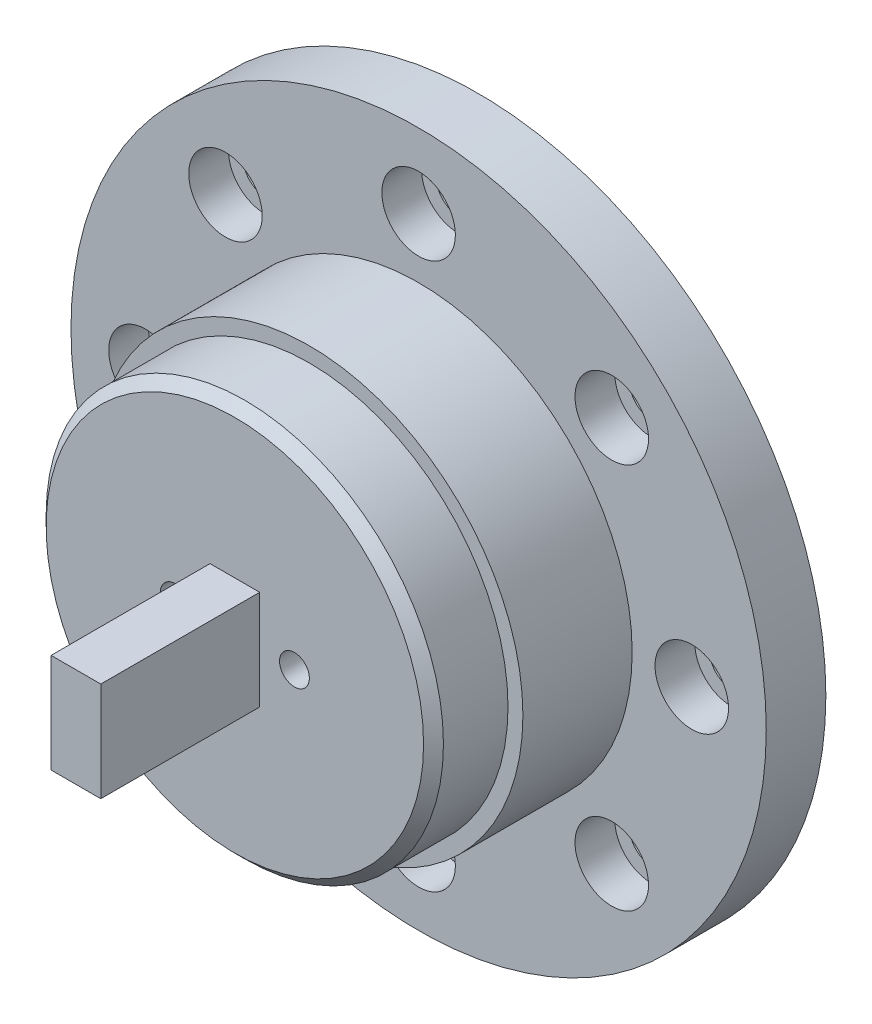
ISO-10303-21;
HEADER;
FILE_DESCRIPTION(('STEP AP214'),'2;1');
FILE_NAME('part.step','',(''),(''),'','','');
FILE_SCHEMA(('AUTOMOTIVE_DESIGN { 1 0 10303 214 1 1 1 1 }'));
ENDSEC;
DATA;
#1=APPLICATION_CONTEXT('core data for automotive mechanical design processes');
#2=APPLICATION_PROTOCOL_DEFINITION('international standard','automotive_design',2000,#1);
#3=PRODUCT_CONTEXT('',#1,'mechanical');
#4=PRODUCT('Part','Part','',(#3));
#5=PRODUCT_RELATED_PRODUCT_CATEGORY('part','',(#4));
#6=PRODUCT_DEFINITION_FORMATION('','',#4);
#7=PRODUCT_DEFINITION_CONTEXT('part definition',#1,'design');
#8=PRODUCT_DEFINITION('design','',#6,#7);
#9=PRODUCT_DEFINITION_SHAPE('','',#8);
#10=(LENGTH_UNIT() NAMED_UNIT(*) SI_UNIT(.MILLI.,.METRE.));
#11=(NAMED_UNIT(*) PLANE_ANGLE_UNIT() SI_UNIT($,.RADIAN.));
#12=(NAMED_UNIT(*) SI_UNIT($,.STERADIAN.) SOLID_ANGLE_UNIT());
#13=UNCERTAINTY_MEASURE_WITH_UNIT(LENGTH_MEASURE(1.E-05),#10,'distance_accuracy_value','');
#14=(GEOMETRIC_REPRESENTATION_CONTEXT(3) GLOBAL_UNCERTAINTY_ASSIGNED_CONTEXT((#13)) GLOBAL_UNIT_ASSIGNED_CONTEXT((#10,
#11,#12)) REPRESENTATION_CONTEXT('',''));
#15=CARTESIAN_POINT('',(0.,0.,0.));
#16=DIRECTION('',(0.,0.,1.));
#17=DIRECTION('',(1.,0.,0.));
#18=AXIS2_PLACEMENT_3D('',#15,#16,#17);
#19=CARTESIAN_POINT('',(0.,0.,2.));
#20=DIRECTION('',(0.,0.,1.));
#21=DIRECTION('',(1.,0.,0.));
#22=AXIS2_PLACEMENT_3D('',#19,#20,#21);
#23=PLANE('',#22);
#24=CARTESIAN_POINT('',(-27.5,0.,2.));
#25=DIRECTION('',(0.,0.,1.));
#26=DIRECTION('',(1.,0.,0.));
#27=AXIS2_PLACEMENT_3D('',#24,#25,#26);
#28=CIRCLE('',#27,2.2);
#29=CARTESIAN_POINT('',(-25.3,0.,2.));
#30=VERTEX_POINT('',#29);
#31=EDGE_CURVE('E192',#30,#30,#28,.T.);
#32=ORIENTED_EDGE('',*,*,#31,.F.);
#33=EDGE_LOOP('',(#32));
#34=FACE_BOUND('',#33,.T.);
#35=CARTESIAN_POINT('',(-27.5,0.,2.));
#36=DIRECTION('',(0.,0.,1.));
#37=DIRECTION('',(1.,0.,0.));
#38=AXIS2_PLACEMENT_3D('',#35,#36,#37);
#39=CIRCLE('',#38,3.7);
#40=CARTESIAN_POINT('',(-23.8,0.,2.));
#41=VERTEX_POINT('',#40);
#42=EDGE_CURVE('E134',#41,#41,#39,.T.);
#43=ORIENTED_EDGE('',*,*,#42,.T.);
#44=EDGE_LOOP('',(#43));
#45=FACE_BOUND('',#44,.T.);
#46=ADVANCED_FACE('F55',(#34,#45),#23,.T.);
#47=CARTESIAN_POINT('',(0.,-27.5,2.));
#48=DIRECTION('',(0.,0.,1.));
#49=DIRECTION('',(1.,0.,0.));
#50=AXIS2_PLACEMENT_3D('',#47,#48,#49);
#51=CIRCLE('',#50,2.2);
#52=CARTESIAN_POINT('',(2.2,-27.5,2.));
#53=VERTEX_POINT('',#52);
#54=EDGE_CURVE('E204',#53,#53,#51,.T.);
#55=ORIENTED_EDGE('',*,*,#54,.F.);
#56=EDGE_LOOP('',(#55));
#57=FACE_BOUND('',#56,.T.);
#58=CARTESIAN_POINT('',(0.,-27.5,2.));
#59=DIRECTION('',(0.,0.,1.));
#60=DIRECTION('',(1.,0.,0.));
#61=AXIS2_PLACEMENT_3D('',#58,#59,#60);
#62=CIRCLE('',#61,3.7);
#63=CARTESIAN_POINT('',(3.7,-27.5,2.));
#64=VERTEX_POINT('',#63);
#65=EDGE_CURVE('E166',#64,#64,#62,.T.);
#66=ORIENTED_EDGE('',*,*,#65,.T.);
#67=EDGE_LOOP('',(#66));
#68=FACE_BOUND('',#67,.T.);
#69=ADVANCED_FACE('F256',(#57,#68),#23,.T.);
#70=CARTESIAN_POINT('',(27.5,0.,2.));
#71=DIRECTION('',(0.,0.,1.));
#72=DIRECTION('',(1.,0.,0.));
#73=AXIS2_PLACEMENT_3D('',#70,#71,#72);
#74=CIRCLE('',#73,2.2);
#75=CARTESIAN_POINT('',(29.7,0.,2.));
#76=VERTEX_POINT('',#75);
#77=EDGE_CURVE('E216',#76,#76,#74,.T.);
#78=ORIENTED_EDGE('',*,*,#77,.F.);
#79=EDGE_LOOP('',(#78));
#80=FACE_BOUND('',#79,.T.);
#81=CARTESIAN_POINT('',(27.5,0.,2.));
#82=DIRECTION('',(0.,0.,1.));
#83=DIRECTION('',(1.,0.,0.));
#84=AXIS2_PLACEMENT_3D('',#81,#82,#83);
#85=CIRCLE('',#84,3.7);
#86=CARTESIAN_POINT('',(31.2,0.,2.));
#87=VERTEX_POINT('',#86);
#88=EDGE_CURVE('E169',#87,#87,#85,.T.);
#89=ORIENTED_EDGE('',*,*,#88,.T.);
#90=EDGE_LOOP('',(#89));
#91=FACE_BOUND('',#90,.T.);
#92=ADVANCED_FACE('F264',(#80,#91),#23,.T.);
#93=CARTESIAN_POINT('',(0.,27.5,2.));
#94=DIRECTION('',(0.,0.,1.));
#95=DIRECTION('',(1.,0.,0.));
#96=AXIS2_PLACEMENT_3D('',#93,#94,#95);
#97=CIRCLE('',#96,2.2);
#98=CARTESIAN_POINT('',(2.2,27.5,2.));
#99=VERTEX_POINT('',#98);
#100=EDGE_CURVE('E228',#99,#99,#97,.T.);
#101=ORIENTED_EDGE('',*,*,#100,.F.);
#102=EDGE_LOOP('',(#101));
#103=FACE_BOUND('',#102,.T.);
#104=CARTESIAN_POINT('',(0.,27.5,2.));
#105=DIRECTION('',(0.,0.,1.));
#106=DIRECTION('',(1.,0.,0.));
#107=AXIS2_PLACEMENT_3D('',#104,#105,#106);
#108=CIRCLE('',#107,3.7);
#109=CARTESIAN_POINT('',(3.7,27.5,2.));
#110=VERTEX_POINT('',#109);
#111=EDGE_CURVE('E172',#110,#110,#108,.T.);
#112=ORIENTED_EDGE('',*,*,#111,.T.);
#113=EDGE_LOOP('',(#112));
#114=FACE_BOUND('',#113,.T.);
#115=ADVANCED_FACE('F383',(#103,#114),#23,.T.);
#116=CARTESIAN_POINT('',(19.4454364826301,19.4454364826301,2.));
#117=DIRECTION('',(0.,0.,1.));
#118=DIRECTION('',(1.,0.,0.));
#119=AXIS2_PLACEMENT_3D('',#116,#117,#118);
#120=CIRCLE('',#119,2.20000000000001);
#121=CARTESIAN_POINT('',(21.6454364826301,19.4454364826301,2.));
#122=VERTEX_POINT('',#121);
#123=EDGE_CURVE('E222',#122,#122,#120,.T.);
#124=ORIENTED_EDGE('',*,*,#123,.F.);
#125=EDGE_LOOP('',(#124));
#126=FACE_BOUND('',#125,.T.);
#127=CARTESIAN_POINT('',(19.4454364826301,19.4454364826301,2.));
#128=DIRECTION('',(0.,0.,1.));
#129=DIRECTION('',(1.,0.,0.));
#130=AXIS2_PLACEMENT_3D('',#127,#128,#129);
#131=CIRCLE('',#130,3.70000000000001);
#132=CARTESIAN_POINT('',(23.1454364826301,19.4454364826301,2.));
#133=VERTEX_POINT('',#132);
#134=EDGE_CURVE('E175',#133,#133,#131,.T.);
#135=ORIENTED_EDGE('',*,*,#134,.T.);
#136=EDGE_LOOP('',(#135));
#137=FACE_BOUND('',#136,.T.);
#138=ADVANCED_FACE('F386',(#126,#137),#23,.T.);
#139=CARTESIAN_POINT('',(19.4454364826301,-19.4454364826301,2.));
#140=DIRECTION('',(0.,0.,1.));
#141=DIRECTION('',(1.,0.,0.));
#142=AXIS2_PLACEMENT_3D('',#139,#140,#141);
#143=CIRCLE('',#142,2.20000000000001);
#144=CARTESIAN_POINT('',(21.6454364826301,-19.4454364826301,2.));
#145=VERTEX_POINT('',#144);
#146=EDGE_CURVE('E210',#145,#145,#143,.T.);
#147=ORIENTED_EDGE('',*,*,#146,.F.);
#148=EDGE_LOOP('',(#147));
#149=FACE_BOUND('',#148,.T.);
#150=CARTESIAN_POINT('',(19.4454364826301,-19.4454364826301,2.));
#151=DIRECTION('',(0.,0.,1.));
#152=DIRECTION('',(1.,0.,0.));
#153=AXIS2_PLACEMENT_3D('',#150,#151,#152);
#154=CIRCLE('',#153,3.70000000000001);
#155=CARTESIAN_POINT('',(23.1454364826301,-19.4454364826301,2.));
#156=VERTEX_POINT('',#155);
#157=EDGE_CURVE('E178',#156,#156,#154,.T.);
#158=ORIENTED_EDGE('',*,*,#157,.T.);
#159=EDGE_LOOP('',(#158));
#160=FACE_BOUND('',#159,.T.);
#161=ADVANCED_FACE('F281',(#149,#160),#23,.T.);
#162=CARTESIAN_POINT('',(-19.4454364826301,-19.4454364826301,2.));
#163=DIRECTION('',(0.,0.,1.));
#164=DIRECTION('',(1.,0.,0.));
#165=AXIS2_PLACEMENT_3D('',#162,#163,#164);
#166=CIRCLE('',#165,2.2);
#167=CARTESIAN_POINT('',(-17.2454364826301,-19.4454364826301,2.));
#168=VERTEX_POINT('',#167);
#169=EDGE_CURVE('E198',#168,#168,#166,.T.);
#170=ORIENTED_EDGE('',*,*,#169,.F.);
#171=EDGE_LOOP('',(#170));
#172=FACE_BOUND('',#171,.T.);
#173=CARTESIAN_POINT('',(-19.4454364826301,-19.4454364826301,2.));
#174=DIRECTION('',(0.,0.,1.));
#175=DIRECTION('',(1.,0.,0.));
#176=AXIS2_PLACEMENT_3D('',#173,#174,#175);
#177=CIRCLE('',#176,3.7);
#178=CARTESIAN_POINT('',(-15.7454364826301,-19.4454364826301,2.));
#179=VERTEX_POINT('',#178);
#180=EDGE_CURVE('E181',#179,#179,#177,.T.);
#181=ORIENTED_EDGE('',*,*,#180,.T.);
#182=EDGE_LOOP('',(#181));
#183=FACE_BOUND('',#182,.T.);
#184=ADVANCED_FACE('F272',(#172,#183),#23,.T.);
#185=CARTESIAN_POINT('',(-19.4454364826301,19.4454364826301,2.));
#186=DIRECTION('',(0.,0.,1.));
#187=DIRECTION('',(1.,0.,0.));
#188=AXIS2_PLACEMENT_3D('',#185,#186,#187);
#189=CIRCLE('',#188,2.2);
#190=CARTESIAN_POINT('',(-17.2454364826301,19.4454364826301,2.));
#191=VERTEX_POINT('',#190);
#192=EDGE_CURVE('E186',#191,#191,#189,.T.);
#193=ORIENTED_EDGE('',*,*,#192,.F.);
#194=EDGE_LOOP('',(#193));
#195=FACE_BOUND('',#194,.T.);
#196=CARTESIAN_POINT('',(-19.4454364826301,19.4454364826301,2.));
#197=DIRECTION('',(0.,0.,1.));
#198=DIRECTION('',(1.,0.,0.));
#199=AXIS2_PLACEMENT_3D('',#196,#197,#198);
#200=CIRCLE('',#199,3.7);
#201=CARTESIAN_POINT('',(-15.7454364826301,19.4454364826301,2.));
#202=VERTEX_POINT('',#201);
#203=EDGE_CURVE('E139',#202,#202,#200,.T.);
#204=ORIENTED_EDGE('',*,*,#203,.T.);
#205=EDGE_LOOP('',(#204));
#206=FACE_BOUND('',#205,.T.);
#207=ADVANCED_FACE('F259',(#195,#206),#23,.T.);
#208=CARTESIAN_POINT('',(0.,0.,0.));
#209=DIRECTION('',(0.,0.,1.));
#210=DIRECTION('',(1.,0.,0.));
#211=AXIS2_PLACEMENT_3D('',#208,#209,#210);
#212=PLANE('',#211);
#213=CARTESIAN_POINT('',(-6.,0.,0.));
#214=DIRECTION('',(0.,0.,1.));
#215=DIRECTION('',(1.,0.,0.));
#216=AXIS2_PLACEMENT_3D('',#213,#214,#215);
#217=CIRCLE('',#216,1.5);
#218=CARTESIAN_POINT('',(-4.5,0.,0.));
#219=VERTEX_POINT('',#218);
#220=EDGE_CURVE('E673',#219,#219,#217,.T.);
#221=ORIENTED_EDGE('',*,*,#220,.T.);
#222=EDGE_LOOP('',(#221));
#223=FACE_BOUND('',#222,.T.);
#224=CARTESIAN_POINT('',(6.,0.,0.));
#225=DIRECTION('',(0.,0.,1.));
#226=DIRECTION('',(1.,0.,0.));
#227=AXIS2_PLACEMENT_3D('',#224,#225,#226);
#228=CIRCLE('',#227,1.5);
#229=CARTESIAN_POINT('',(7.5,0.,0.));
#230=VERTEX_POINT('',#229);
#231=EDGE_CURVE('E665',#230,#230,#228,.T.);
#232=ORIENTED_EDGE('',*,*,#231,.T.);
#233=EDGE_LOOP('',(#232));
#234=FACE_BOUND('',#233,.T.);
#235=CARTESIAN_POINT('',(0.,0.,0.));
#236=DIRECTION('',(0.,0.,1.));
#237=DIRECTION('',(1.,0.,0.));
#238=AXIS2_PLACEMENT_3D('',#235,#236,#237);
#239=CIRCLE('',#238,35.);
#240=CARTESIAN_POINT('',(35.,0.,0.));
#241=VERTEX_POINT('',#240);
#242=EDGE_CURVE('E231',#241,#241,#239,.T.);
#243=ORIENTED_EDGE('',*,*,#242,.F.);
#244=EDGE_LOOP('',(#243));
#245=FACE_BOUND('',#244,.T.);
#246=CARTESIAN_POINT('',(0.,27.5,0.));
#247=DIRECTION('',(0.,0.,1.));
#248=DIRECTION('',(1.,0.,0.));
#249=AXIS2_PLACEMENT_3D('',#246,#247,#248);
#250=CIRCLE('',#249,2.2);
#251=CARTESIAN_POINT('',(2.2,27.5,0.));
#252=VERTEX_POINT('',#251);
#253=EDGE_CURVE('E225',#252,#252,#250,.T.);
#254=ORIENTED_EDGE('',*,*,#253,.T.);
#255=EDGE_LOOP('',(#254));
#256=FACE_BOUND('',#255,.T.);
#257=CARTESIAN_POINT('',(19.4454364826301,19.4454364826301,0.));
#258=DIRECTION('',(0.,0.,1.));
#259=DIRECTION('',(1.,0.,0.));
#260=AXIS2_PLACEMENT_3D('',#257,#258,#259);
#261=CIRCLE('',#260,2.20000000000001);
#262=CARTESIAN_POINT('',(21.6454364826301,19.4454364826301,0.));
#263=VERTEX_POINT('',#262);
#264=EDGE_CURVE('E219',#263,#263,#261,.T.);
#265=ORIENTED_EDGE('',*,*,#264,.T.);
#266=EDGE_LOOP('',(#265));
#267=FACE_BOUND('',#266,.T.);
#268=CARTESIAN_POINT('',(27.5,0.,0.));
#269=DIRECTION('',(0.,0.,1.));
#270=DIRECTION('',(1.,0.,0.));
#271=AXIS2_PLACEMENT_3D('',#268,#269,#270);
#272=CIRCLE('',#271,2.2);
#273=CARTESIAN_POINT('',(29.7,0.,0.));
#274=VERTEX_POINT('',#273);
#275=EDGE_CURVE('E213',#274,#274,#272,.T.);
#276=ORIENTED_EDGE('',*,*,#275,.T.);
#277=EDGE_LOOP('',(#276));
#278=FACE_BOUND('',#277,.T.);
#279=CARTESIAN_POINT('',(19.4454364826301,-19.4454364826301,0.));
#280=DIRECTION('',(0.,0.,1.));
#281=DIRECTION('',(1.,0.,0.));
#282=AXIS2_PLACEMENT_3D('',#279,#280,#281);
#283=CIRCLE('',#282,2.20000000000001);
#284=CARTESIAN_POINT('',(21.6454364826301,-19.4454364826301,0.));
#285=VERTEX_POINT('',#284);
#286=EDGE_CURVE('E207',#285,#285,#283,.T.);
#287=ORIENTED_EDGE('',*,*,#286,.T.);
#288=EDGE_LOOP('',(#287));
#289=FACE_BOUND('',#288,.T.);
#290=CARTESIAN_POINT('',(0.,-27.5,0.));
#291=DIRECTION('',(0.,0.,1.));
#292=DIRECTION('',(1.,0.,0.));
#293=AXIS2_PLACEMENT_3D('',#290,#291,#292);
#294=CIRCLE('',#293,2.2);
#295=CARTESIAN_POINT('',(2.2,-27.5,0.));
#296=VERTEX_POINT('',#295);
#297=EDGE_CURVE('E201',#296,#296,#294,.T.);
#298=ORIENTED_EDGE('',*,*,#297,.T.);
#299=EDGE_LOOP('',(#298));
#300=FACE_BOUND('',#299,.T.);
#301=CARTESIAN_POINT('',(-19.4454364826301,-19.4454364826301,0.));
#302=DIRECTION('',(0.,0.,1.));
#303=DIRECTION('',(1.,0.,0.));
#304=AXIS2_PLACEMENT_3D('',#301,#302,#303);
#305=CIRCLE('',#304,2.2);
#306=CARTESIAN_POINT('',(-17.2454364826301,-19.4454364826301,0.));
#307=VERTEX_POINT('',#306);
#308=EDGE_CURVE('E195',#307,#307,#305,.T.);
#309=ORIENTED_EDGE('',*,*,#308,.T.);
#310=EDGE_LOOP('',(#309));
#311=FACE_BOUND('',#310,.T.);
#312=CARTESIAN_POINT('',(-27.5,0.,0.));
#313=DIRECTION('',(0.,0.,1.));
#314=DIRECTION('',(1.,0.,0.));
#315=AXIS2_PLACEMENT_3D('',#312,#313,#314);
#316=CIRCLE('',#315,2.2);
#317=CARTESIAN_POINT('',(-25.3,0.,0.));
#318=VERTEX_POINT('',#317);
#319=EDGE_CURVE('E189',#318,#318,#316,.T.);
#320=ORIENTED_EDGE('',*,*,#319,.T.);
#321=EDGE_LOOP('',(#320));
#322=FACE_BOUND('',#321,.T.);
#323=CARTESIAN_POINT('',(-19.4454364826301,19.4454364826301,0.));
#324=DIRECTION('',(0.,0.,1.));
#325=DIRECTION('',(1.,0.,0.));
#326=AXIS2_PLACEMENT_3D('',#323,#324,#325);
#327=CIRCLE('',#326,2.2);
#328=CARTESIAN_POINT('',(-17.2454364826301,19.4454364826301,0.));
#329=VERTEX_POINT('',#328);
#330=EDGE_CURVE('E163',#329,#329,#327,.T.);
#331=ORIENTED_EDGE('',*,*,#330,.T.);
#332=EDGE_LOOP('',(#331));
#333=FACE_BOUND('',#332,.T.);
#334=ADVANCED_FACE('F271',(#223,#234,#245,#256,#267,#278,#289,#300,#311,#322,#333),#212,.F.);
#335=CARTESIAN_POINT('',(0.,0.,2.));
#336=DIRECTION('',(0.,0.,-1.));
#337=DIRECTION('',(-1.,0.,0.));
#338=AXIS2_PLACEMENT_3D('',#335,#336,#337);
#339=CYLINDRICAL_SURFACE('',#338,35.);
#340=ORIENTED_EDGE('',*,*,#242,.T.);
#341=EDGE_LOOP('',(#340));
#342=FACE_BOUND('',#341,.T.);
#343=CARTESIAN_POINT('',(0.,0.,6.));
#344=DIRECTION('',(0.,0.,1.));
#345=DIRECTION('',(1.,0.,0.));
#346=AXIS2_PLACEMENT_3D('',#343,#344,#345);
#347=CIRCLE('',#346,35.);
#348=CARTESIAN_POINT('',(35.,0.,6.));
#349=VERTEX_POINT('',#348);
#350=EDGE_CURVE('E160',#349,#349,#347,.T.);
#351=ORIENTED_EDGE('',*,*,#350,.F.);
#352=EDGE_LOOP('',(#351));
#353=FACE_BOUND('',#352,.T.);
#354=ADVANCED_FACE('F279',(#342,#353),#339,.T.);
#355=CARTESIAN_POINT('',(0.,27.5,2.));
#356=DIRECTION('',(0.,0.,-1.));
#357=DIRECTION('',(-1.,0.,0.));
#358=AXIS2_PLACEMENT_3D('',#355,#356,#357);
#359=CYLINDRICAL_SURFACE('',#358,2.2);
#360=ORIENTED_EDGE('',*,*,#100,.T.);
#361=EDGE_LOOP('',(#360));
#362=FACE_BOUND('',#361,.T.);
#363=ORIENTED_EDGE('',*,*,#253,.F.);
#364=EDGE_LOOP('',(#363));
#365=FACE_BOUND('',#364,.T.);
#366=ADVANCED_FACE('F350',(#362,#365),#359,.F.);
#367=CARTESIAN_POINT('',(19.4454364826301,19.4454364826301,2.));
#368=DIRECTION('',(0.,0.,-1.));
#369=DIRECTION('',(-1.,0.,0.));
#370=AXIS2_PLACEMENT_3D('',#367,#368,#369);
#371=CYLINDRICAL_SURFACE('',#370,2.20000000000001);
#372=ORIENTED_EDGE('',*,*,#123,.T.);
#373=EDGE_LOOP('',(#372));
#374=FACE_BOUND('',#373,.T.);
#375=ORIENTED_EDGE('',*,*,#264,.F.);
#376=EDGE_LOOP('',(#375));
#377=FACE_BOUND('',#376,.T.);
#378=ADVANCED_FACE('F347',(#374,#377),#371,.F.);
#379=CARTESIAN_POINT('',(27.5,0.,2.));
#380=DIRECTION('',(0.,0.,-1.));
#381=DIRECTION('',(-1.,0.,0.));
#382=AXIS2_PLACEMENT_3D('',#379,#380,#381);
#383=CYLINDRICAL_SURFACE('',#382,2.2);
#384=ORIENTED_EDGE('',*,*,#77,.T.);
#385=EDGE_LOOP('',(#384));
#386=FACE_BOUND('',#385,.T.);
#387=ORIENTED_EDGE('',*,*,#275,.F.);
#388=EDGE_LOOP('',(#387));
#389=FACE_BOUND('',#388,.T.);
#390=ADVANCED_FACE('F343',(#386,#389),#383,.F.);
#391=CARTESIAN_POINT('',(19.4454364826301,-19.4454364826301,2.));
#392=DIRECTION('',(0.,0.,-1.));
#393=DIRECTION('',(-1.,0.,0.));
#394=AXIS2_PLACEMENT_3D('',#391,#392,#393);
#395=CYLINDRICAL_SURFACE('',#394,2.20000000000001);
#396=ORIENTED_EDGE('',*,*,#146,.T.);
#397=EDGE_LOOP('',(#396));
#398=FACE_BOUND('',#397,.T.);
#399=ORIENTED_EDGE('',*,*,#286,.F.);
#400=EDGE_LOOP('',(#399));
#401=FACE_BOUND('',#400,.T.);
#402=ADVANCED_FACE('F339',(#398,#401),#395,.F.);
#403=CARTESIAN_POINT('',(0.,-27.5,2.));
#404=DIRECTION('',(0.,0.,-1.));
#405=DIRECTION('',(-1.,0.,0.));
#406=AXIS2_PLACEMENT_3D('',#403,#404,#405);
#407=CYLINDRICAL_SURFACE('',#406,2.2);
#408=ORIENTED_EDGE('',*,*,#54,.T.);
#409=EDGE_LOOP('',(#408));
#410=FACE_BOUND('',#409,.T.);
#411=ORIENTED_EDGE('',*,*,#297,.F.);
#412=EDGE_LOOP('',(#411));
#413=FACE_BOUND('',#412,.T.);
#414=ADVANCED_FACE('F335',(#410,#413),#407,.F.);
#415=CARTESIAN_POINT('',(-19.4454364826301,-19.4454364826301,2.));
#416=DIRECTION('',(0.,0.,-1.));
#417=DIRECTION('',(-1.,0.,0.));
#418=AXIS2_PLACEMENT_3D('',#415,#416,#417);
#419=CYLINDRICAL_SURFACE('',#418,2.2);
#420=ORIENTED_EDGE('',*,*,#169,.T.);
#421=EDGE_LOOP('',(#420));
#422=FACE_BOUND('',#421,.T.);
#423=ORIENTED_EDGE('',*,*,#308,.F.);
#424=EDGE_LOOP('',(#423));
#425=FACE_BOUND('',#424,.T.);
#426=ADVANCED_FACE('F331',(#422,#425),#419,.F.);
#427=CARTESIAN_POINT('',(-27.5,0.,2.));
#428=DIRECTION('',(0.,0.,-1.));
#429=DIRECTION('',(-1.,0.,0.));
#430=AXIS2_PLACEMENT_3D('',#427,#428,#429);
#431=CYLINDRICAL_SURFACE('',#430,2.2);
#432=ORIENTED_EDGE('',*,*,#31,.T.);
#433=EDGE_LOOP('',(#432));
#434=FACE_BOUND('',#433,.T.);
#435=ORIENTED_EDGE('',*,*,#319,.F.);
#436=EDGE_LOOP('',(#435));
#437=FACE_BOUND('',#436,.T.);
#438=ADVANCED_FACE('F299',(#434,#437),#431,.F.);
#439=CARTESIAN_POINT('',(-19.4454364826301,19.4454364826301,2.));
#440=DIRECTION('',(0.,0.,-1.));
#441=DIRECTION('',(-1.,0.,0.));
#442=AXIS2_PLACEMENT_3D('',#439,#440,#441);
#443=CYLINDRICAL_SURFACE('',#442,2.2);
#444=ORIENTED_EDGE('',*,*,#192,.T.);
#445=EDGE_LOOP('',(#444));
#446=FACE_BOUND('',#445,.T.);
#447=ORIENTED_EDGE('',*,*,#330,.F.);
#448=EDGE_LOOP('',(#447));
#449=FACE_BOUND('',#448,.T.);
#450=ADVANCED_FACE('F290',(#446,#449),#443,.F.);
#451=CARTESIAN_POINT('',(-19.4454364826301,19.4454364826301,6.));
#452=DIRECTION('',(0.,0.,-1.));
#453=DIRECTION('',(-1.,0.,0.));
#454=AXIS2_PLACEMENT_3D('',#451,#452,#453);
#455=CYLINDRICAL_SURFACE('',#454,3.7);
#456=CARTESIAN_POINT('',(-19.4454364826301,19.4454364826301,6.));
#457=DIRECTION('',(0.,0.,1.));
#458=DIRECTION('',(1.,0.,0.));
#459=AXIS2_PLACEMENT_3D('',#456,#457,#458);
#460=CIRCLE('',#459,3.7);
#461=CARTESIAN_POINT('',(-15.7454364826301,19.4454364826301,6.));
#462=VERTEX_POINT('',#461);
#463=EDGE_CURVE('E157',#462,#462,#460,.T.);
#464=ORIENTED_EDGE('',*,*,#463,.T.);
#465=EDGE_LOOP('',(#464));
#466=FACE_BOUND('',#465,.T.);
#467=ORIENTED_EDGE('',*,*,#203,.F.);
#468=EDGE_LOOP('',(#467));
#469=FACE_BOUND('',#468,.T.);
#470=ADVANCED_FACE('F287',(#466,#469),#455,.F.);
#471=CARTESIAN_POINT('',(-19.4454364826301,-19.4454364826301,6.));
#472=DIRECTION('',(0.,0.,-1.));
#473=DIRECTION('',(-1.,0.,0.));
#474=AXIS2_PLACEMENT_3D('',#471,#472,#473);
#475=CYLINDRICAL_SURFACE('',#474,3.7);
#476=CARTESIAN_POINT('',(-19.4454364826301,-19.4454364826301,6.));
#477=DIRECTION('',(0.,0.,1.));
#478=DIRECTION('',(1.,0.,0.));
#479=AXIS2_PLACEMENT_3D('',#476,#477,#478);
#480=CIRCLE('',#479,3.7);
#481=CARTESIAN_POINT('',(-15.7454364826301,-19.4454364826301,6.));
#482=VERTEX_POINT('',#481);
#483=EDGE_CURVE('E154',#482,#482,#480,.T.);
#484=ORIENTED_EDGE('',*,*,#483,.T.);
#485=EDGE_LOOP('',(#484));
#486=FACE_BOUND('',#485,.T.);
#487=ORIENTED_EDGE('',*,*,#180,.F.);
#488=EDGE_LOOP('',(#487));
#489=FACE_BOUND('',#488,.T.);
#490=ADVANCED_FACE('F289',(#486,#489),#475,.F.);
#491=CARTESIAN_POINT('',(19.4454364826301,-19.4454364826301,6.));
#492=DIRECTION('',(0.,0.,-1.));
#493=DIRECTION('',(-1.,0.,0.));
#494=AXIS2_PLACEMENT_3D('',#491,#492,#493);
#495=CYLINDRICAL_SURFACE('',#494,3.70000000000001);
#496=CARTESIAN_POINT('',(19.4454364826301,-19.4454364826301,6.));
#497=DIRECTION('',(0.,0.,1.));
#498=DIRECTION('',(1.,0.,0.));
#499=AXIS2_PLACEMENT_3D('',#496,#497,#498);
#500=CIRCLE('',#499,3.70000000000001);
#501=CARTESIAN_POINT('',(23.1454364826301,-19.4454364826301,6.));
#502=VERTEX_POINT('',#501);
#503=EDGE_CURVE('E151',#502,#502,#500,.T.);
#504=ORIENTED_EDGE('',*,*,#503,.T.);
#505=EDGE_LOOP('',(#504));
#506=FACE_BOUND('',#505,.T.);
#507=ORIENTED_EDGE('',*,*,#157,.F.);
#508=EDGE_LOOP('',(#507));
#509=FACE_BOUND('',#508,.T.);
#510=ADVANCED_FACE('F296',(#506,#509),#495,.F.);
#511=CARTESIAN_POINT('',(19.4454364826301,19.4454364826301,6.));
#512=DIRECTION('',(0.,0.,-1.));
#513=DIRECTION('',(-1.,0.,0.));
#514=AXIS2_PLACEMENT_3D('',#511,#512,#513);
#515=CYLINDRICAL_SURFACE('',#514,3.70000000000001);
#516=CARTESIAN_POINT('',(19.4454364826301,19.4454364826301,6.));
#517=DIRECTION('',(0.,0.,1.));
#518=DIRECTION('',(1.,0.,0.));
#519=AXIS2_PLACEMENT_3D('',#516,#517,#518);
#520=CIRCLE('',#519,3.70000000000001);
#521=CARTESIAN_POINT('',(23.1454364826301,19.4454364826301,6.));
#522=VERTEX_POINT('',#521);
#523=EDGE_CURVE('E148',#522,#522,#520,.T.);
#524=ORIENTED_EDGE('',*,*,#523,.T.);
#525=EDGE_LOOP('',(#524));
#526=FACE_BOUND('',#525,.T.);
#527=ORIENTED_EDGE('',*,*,#134,.F.);
#528=EDGE_LOOP('',(#527));
#529=FACE_BOUND('',#528,.T.);
#530=ADVANCED_FACE('F308',(#526,#529),#515,.F.);
#531=CARTESIAN_POINT('',(0.,27.5,6.));
#532=DIRECTION('',(0.,0.,-1.));
#533=DIRECTION('',(-1.,0.,0.));
#534=AXIS2_PLACEMENT_3D('',#531,#532,#533);
#535=CYLINDRICAL_SURFACE('',#534,3.7);
#536=CARTESIAN_POINT('',(0.,27.5,6.));
#537=DIRECTION('',(0.,0.,1.));
#538=DIRECTION('',(1.,0.,0.));
#539=AXIS2_PLACEMENT_3D('',#536,#537,#538);
#540=CIRCLE('',#539,3.7);
#541=CARTESIAN_POINT('',(3.7,27.5,6.));
#542=VERTEX_POINT('',#541);
#543=EDGE_CURVE('E145',#542,#542,#540,.T.);
#544=ORIENTED_EDGE('',*,*,#543,.T.);
#545=EDGE_LOOP('',(#544));
#546=FACE_BOUND('',#545,.T.);
#547=ORIENTED_EDGE('',*,*,#111,.F.);
#548=EDGE_LOOP('',(#547));
#549=FACE_BOUND('',#548,.T.);
#550=ADVANCED_FACE('F312',(#546,#549),#535,.F.);
#551=CARTESIAN_POINT('',(27.5,0.,6.));
#552=DIRECTION('',(0.,0.,-1.));
#553=DIRECTION('',(-1.,0.,0.));
#554=AXIS2_PLACEMENT_3D('',#551,#552,#553);
#555=CYLINDRICAL_SURFACE('',#554,3.7);
#556=CARTESIAN_POINT('',(27.5,0.,6.));
#557=DIRECTION('',(0.,0.,1.));
#558=DIRECTION('',(1.,0.,0.));
#559=AXIS2_PLACEMENT_3D('',#556,#557,#558);
#560=CIRCLE('',#559,3.7);
#561=CARTESIAN_POINT('',(31.2,0.,6.));
#562=VERTEX_POINT('',#561);
#563=EDGE_CURVE('E142',#562,#562,#560,.T.);
#564=ORIENTED_EDGE('',*,*,#563,.T.);
#565=EDGE_LOOP('',(#564));
#566=FACE_BOUND('',#565,.T.);
#567=ORIENTED_EDGE('',*,*,#88,.F.);
#568=EDGE_LOOP('',(#567));
#569=FACE_BOUND('',#568,.T.);
#570=ADVANCED_FACE('F316',(#566,#569),#555,.F.);
#571=CARTESIAN_POINT('',(0.,-27.5,6.));
#572=DIRECTION('',(0.,0.,-1.));
#573=DIRECTION('',(-1.,0.,0.));
#574=AXIS2_PLACEMENT_3D('',#571,#572,#573);
#575=CYLINDRICAL_SURFACE('',#574,3.7);
#576=CARTESIAN_POINT('',(0.,-27.5,6.));
#577=DIRECTION('',(0.,0.,1.));
#578=DIRECTION('',(1.,0.,0.));
#579=AXIS2_PLACEMENT_3D('',#576,#577,#578);
#580=CIRCLE('',#579,3.7);
#581=CARTESIAN_POINT('',(3.7,-27.5,6.));
#582=VERTEX_POINT('',#581);
#583=EDGE_CURVE('E138',#582,#582,#580,.T.);
#584=ORIENTED_EDGE('',*,*,#583,.T.);
#585=EDGE_LOOP('',(#584));
#586=FACE_BOUND('',#585,.T.);
#587=ORIENTED_EDGE('',*,*,#65,.F.);
#588=EDGE_LOOP('',(#587));
#589=FACE_BOUND('',#588,.T.);
#590=ADVANCED_FACE('F320',(#586,#589),#575,.F.);
#591=CARTESIAN_POINT('',(-27.5,0.,6.));
#592=DIRECTION('',(0.,0.,-1.));
#593=DIRECTION('',(-1.,0.,0.));
#594=AXIS2_PLACEMENT_3D('',#591,#592,#593);
#595=CYLINDRICAL_SURFACE('',#594,3.7);
#596=CARTESIAN_POINT('',(-27.5,0.,6.));
#597=DIRECTION('',(0.,0.,1.));
#598=DIRECTION('',(1.,0.,0.));
#599=AXIS2_PLACEMENT_3D('',#596,#597,#598);
#600=CIRCLE('',#599,3.7);
#601=CARTESIAN_POINT('',(-23.8,0.,6.));
#602=VERTEX_POINT('',#601);
#603=EDGE_CURVE('E135',#602,#602,#600,.T.);
#604=ORIENTED_EDGE('',*,*,#603,.T.);
#605=EDGE_LOOP('',(#604));
#606=FACE_BOUND('',#605,.T.);
#607=ORIENTED_EDGE('',*,*,#42,.F.);
#608=EDGE_LOOP('',(#607));
#609=FACE_BOUND('',#608,.T.);
#610=ADVANCED_FACE('F324',(#606,#609),#595,.F.);
#611=CARTESIAN_POINT('',(0.,0.,6.));
#612=DIRECTION('',(0.,0.,1.));
#613=DIRECTION('',(1.,0.,0.));
#614=AXIS2_PLACEMENT_3D('',#611,#612,#613);
#615=PLANE('',#614);
#616=CARTESIAN_POINT('',(0.,0.,6.));
#617=DIRECTION('',(0.,0.,1.));
#618=DIRECTION('',(1.,0.,0.));
#619=AXIS2_PLACEMENT_3D('',#616,#617,#618);
#620=CIRCLE('',#619,21.5);
#621=CARTESIAN_POINT('',(21.5,0.,6.));
#622=VERTEX_POINT('',#621);
#623=EDGE_CURVE('E680',#622,#622,#620,.T.);
#624=ORIENTED_EDGE('',*,*,#623,.F.);
#625=EDGE_LOOP('',(#624));
#626=FACE_BOUND('',#625,.T.);
#627=ORIENTED_EDGE('',*,*,#603,.F.);
#628=EDGE_LOOP('',(#627));
#629=FACE_BOUND('',#628,.T.);
#630=ORIENTED_EDGE('',*,*,#583,.F.);
#631=EDGE_LOOP('',(#630));
#632=FACE_BOUND('',#631,.T.);
#633=ORIENTED_EDGE('',*,*,#563,.F.);
#634=EDGE_LOOP('',(#633));
#635=FACE_BOUND('',#634,.T.);
#636=ORIENTED_EDGE('',*,*,#543,.F.);
#637=EDGE_LOOP('',(#636));
#638=FACE_BOUND('',#637,.T.);
#639=ORIENTED_EDGE('',*,*,#523,.F.);
#640=EDGE_LOOP('',(#639));
#641=FACE_BOUND('',#640,.T.);
#642=ORIENTED_EDGE('',*,*,#503,.F.);
#643=EDGE_LOOP('',(#642));
#644=FACE_BOUND('',#643,.T.);
#645=ORIENTED_EDGE('',*,*,#483,.F.);
#646=EDGE_LOOP('',(#645));
#647=FACE_BOUND('',#646,.T.);
#648=ORIENTED_EDGE('',*,*,#463,.F.);
#649=EDGE_LOOP('',(#648));
#650=FACE_BOUND('',#649,.T.);
#651=ORIENTED_EDGE('',*,*,#350,.T.);
#652=EDGE_LOOP('',(#651));
#653=FACE_BOUND('',#652,.T.);
#654=ADVANCED_FACE('F303',(#626,#629,#632,#635,#638,#641,#644,#647,#650,#653),#615,.T.);
#655=CARTESIAN_POINT('',(0.,0.,17.));
#656=DIRECTION('',(0.,0.,-1.));
#657=DIRECTION('',(-1.,0.,0.));
#658=AXIS2_PLACEMENT_3D('',#655,#656,#657);
#659=CYLINDRICAL_SURFACE('',#658,21.5);
#660=CARTESIAN_POINT('',(0.,0.,17.));
#661=DIRECTION('',(0.,0.,1.));
#662=DIRECTION('',(1.,0.,0.));
#663=AXIS2_PLACEMENT_3D('',#660,#661,#662);
#664=CIRCLE('',#663,21.5);
#665=CARTESIAN_POINT('',(21.5,0.,17.));
#666=VERTEX_POINT('',#665);
#667=EDGE_CURVE('E237',#666,#666,#664,.T.);
#668=ORIENTED_EDGE('',*,*,#667,.F.);
#669=EDGE_LOOP('',(#668));
#670=FACE_BOUND('',#669,.T.);
#671=ORIENTED_EDGE('',*,*,#623,.T.);
#672=EDGE_LOOP('',(#671));
#673=FACE_BOUND('',#672,.T.);
#674=ADVANCED_FACE('F459',(#670,#673),#659,.T.);
#675=CARTESIAN_POINT('',(0.,0.,17.));
#676=DIRECTION('',(0.,0.,1.));
#677=DIRECTION('',(1.,0.,0.));
#678=AXIS2_PLACEMENT_3D('',#675,#676,#677);
#679=PLANE('',#678);
#680=CARTESIAN_POINT('',(0.,0.,17.));
#681=DIRECTION('',(0.,0.,1.));
#682=DIRECTION('',(1.,0.,0.));
#683=AXIS2_PLACEMENT_3D('',#680,#681,#682);
#684=CIRCLE('',#683,20.);
#685=CARTESIAN_POINT('',(20.,0.,17.));
#686=VERTEX_POINT('',#685);
#687=EDGE_CURVE('E126',#686,#686,#684,.T.);
#688=ORIENTED_EDGE('',*,*,#687,.F.);
#689=EDGE_LOOP('',(#688));
#690=FACE_BOUND('',#689,.T.);
#691=ORIENTED_EDGE('',*,*,#667,.T.);
#692=EDGE_LOOP('',(#691));
#693=FACE_BOUND('',#692,.T.);
#694=ADVANCED_FACE('F513',(#690,#693),#679,.T.);
#695=CARTESIAN_POINT('',(0.,0.,40.5));
#696=DIRECTION('',(0.,0.,1.));
#697=DIRECTION('',(1.,0.,0.));
#698=AXIS2_PLACEMENT_3D('',#695,#696,#697);
#699=PLANE('',#698);
#700=DIRECTION('',(0.,-1.,0.));
#701=VECTOR('',#700,1.);
#702=CARTESIAN_POINT('',(-2.5,-5.,40.5));
#703=LINE('',#702,#701);
#704=CARTESIAN_POINT('',(-2.5,5.,40.5));
#705=VERTEX_POINT('',#704);
#706=CARTESIAN_POINT('',(-2.5,-5.,40.5));
#707=VERTEX_POINT('',#706);
#708=EDGE_CURVE('E105',#705,#707,#703,.T.);
#709=ORIENTED_EDGE('',*,*,#708,.T.);
#710=DIRECTION('',(1.,0.,0.));
#711=VECTOR('',#710,1.);
#712=CARTESIAN_POINT('',(2.5,-5.,40.5));
#713=LINE('',#712,#711);
#714=CARTESIAN_POINT('',(2.5,-5.,40.5));
#715=VERTEX_POINT('',#714);
#716=EDGE_CURVE('E100',#707,#715,#713,.T.);
#717=ORIENTED_EDGE('',*,*,#716,.T.);
#718=DIRECTION('',(0.,1.,0.));
#719=VECTOR('',#718,1.);
#720=CARTESIAN_POINT('',(2.5,-5.,40.5));
#721=LINE('',#720,#719);
#722=CARTESIAN_POINT('',(2.5,5.,40.5));
#723=VERTEX_POINT('',#722);
#724=EDGE_CURVE('E103',#715,#723,#721,.T.);
#725=ORIENTED_EDGE('',*,*,#724,.T.);
#726=DIRECTION('',(-1.,0.,0.));
#727=VECTOR('',#726,1.);
#728=CARTESIAN_POINT('',(2.5,5.,40.5));
#729=LINE('',#728,#727);
#730=EDGE_CURVE('E79',#723,#705,#729,.T.);
#731=ORIENTED_EDGE('',*,*,#730,.T.);
#732=EDGE_LOOP('',(#709,#717,#725,#731));
#733=FACE_BOUND('',#732,.T.);
#734=ADVANCED_FACE('F101',(#733),#699,.T.);
#735=CARTESIAN_POINT('',(2.5,-5.,40.5));
#736=DIRECTION('',(-1.,0.,0.));
#737=DIRECTION('',(0.,0.,1.));
#738=AXIS2_PLACEMENT_3D('',#735,#736,#737);
#739=PLANE('',#738);
#740=DIRECTION('',(0.,1.,0.));
#741=VECTOR('',#740,1.);
#742=CARTESIAN_POINT('',(2.5,-5.,24.5));
#743=LINE('',#742,#741);
#744=CARTESIAN_POINT('',(2.5,-5.,24.5));
#745=VERTEX_POINT('',#744);
#746=CARTESIAN_POINT('',(2.5,5.,24.5));
#747=VERTEX_POINT('',#746);
#748=EDGE_CURVE('E128',#745,#747,#743,.T.);
#749=ORIENTED_EDGE('',*,*,#748,.T.);
#750=DIRECTION('',(0.,0.,-1.));
#751=VECTOR('',#750,1.);
#752=CARTESIAN_POINT('',(2.5,5.,40.5));
#753=LINE('',#752,#751);
#754=EDGE_CURVE('E71',#723,#747,#753,.T.);
#755=ORIENTED_EDGE('',*,*,#754,.F.);
#756=ORIENTED_EDGE('',*,*,#724,.F.);
#757=DIRECTION('',(0.,0.,-1.));
#758=VECTOR('',#757,1.);
#759=CARTESIAN_POINT('',(2.5,-5.,40.5));
#760=LINE('',#759,#758);
#761=EDGE_CURVE('E109',#715,#745,#760,.T.);
#762=ORIENTED_EDGE('',*,*,#761,.T.);
#763=EDGE_LOOP('',(#749,#755,#756,#762));
#764=FACE_BOUND('',#763,.T.);
#765=ADVANCED_FACE('F117',(#764),#739,.F.);
#766=CARTESIAN_POINT('',(2.5,5.,40.5));
#767=DIRECTION('',(0.,-1.,0.));
#768=DIRECTION('',(0.,0.,-1.));
#769=AXIS2_PLACEMENT_3D('',#766,#767,#768);
#770=PLANE('',#769);
#771=DIRECTION('',(-1.,0.,0.));
#772=VECTOR('',#771,1.);
#773=CARTESIAN_POINT('',(2.5,5.,24.5));
#774=LINE('',#773,#772);
#775=CARTESIAN_POINT('',(-2.5,5.,24.5));
#776=VERTEX_POINT('',#775);
#777=EDGE_CURVE('E93',#747,#776,#774,.T.);
#778=ORIENTED_EDGE('',*,*,#777,.T.);
#779=DIRECTION('',(0.,0.,-1.));
#780=VECTOR('',#779,1.);
#781=CARTESIAN_POINT('',(-2.5,5.,40.5));
#782=LINE('',#781,#780);
#783=EDGE_CURVE('E119',#705,#776,#782,.T.);
#784=ORIENTED_EDGE('',*,*,#783,.F.);
#785=ORIENTED_EDGE('',*,*,#730,.F.);
#786=ORIENTED_EDGE('',*,*,#754,.T.);
#787=EDGE_LOOP('',(#778,#784,#785,#786));
#788=FACE_BOUND('',#787,.T.);
#789=ADVANCED_FACE('F483',(#788),#770,.F.);
#790=CARTESIAN_POINT('',(-2.5,-5.,40.5));
#791=DIRECTION('',(1.,0.,0.));
#792=DIRECTION('',(0.,1.,0.));
#793=AXIS2_PLACEMENT_3D('',#790,#791,#792);
#794=PLANE('',#793);
#795=DIRECTION('',(0.,-1.,0.));
#796=VECTOR('',#795,1.);
#797=CARTESIAN_POINT('',(-2.5,-5.,24.5));
#798=LINE('',#797,#796);
#799=CARTESIAN_POINT('',(-2.5,-5.,24.5));
#800=VERTEX_POINT('',#799);
#801=EDGE_CURVE('E123',#776,#800,#798,.T.);
#802=ORIENTED_EDGE('',*,*,#801,.T.);
#803=DIRECTION('',(0.,0.,-1.));
#804=VECTOR('',#803,1.);
#805=CARTESIAN_POINT('',(-2.5,-5.,40.5));
#806=LINE('',#805,#804);
#807=EDGE_CURVE('E115',#707,#800,#806,.T.);
#808=ORIENTED_EDGE('',*,*,#807,.F.);
#809=ORIENTED_EDGE('',*,*,#708,.F.);
#810=ORIENTED_EDGE('',*,*,#783,.T.);
#811=EDGE_LOOP('',(#802,#808,#809,#810));
#812=FACE_BOUND('',#811,.T.);
#813=ADVANCED_FACE('F479',(#812),#794,.F.);
#814=CARTESIAN_POINT('',(2.5,-5.,40.5));
#815=DIRECTION('',(0.,1.,0.));
#816=DIRECTION('',(-1.,0.,0.));
#817=AXIS2_PLACEMENT_3D('',#814,#815,#816);
#818=PLANE('',#817);
#819=DIRECTION('',(1.,0.,0.));
#820=VECTOR('',#819,1.);
#821=CARTESIAN_POINT('',(2.5,-5.,24.5));
#822=LINE('',#821,#820);
#823=EDGE_CURVE('E112',#800,#745,#822,.T.);
#824=ORIENTED_EDGE('',*,*,#823,.T.);
#825=ORIENTED_EDGE('',*,*,#761,.F.);
#826=ORIENTED_EDGE('',*,*,#716,.F.);
#827=ORIENTED_EDGE('',*,*,#807,.T.);
#828=EDGE_LOOP('',(#824,#825,#826,#827));
#829=FACE_BOUND('',#828,.T.);
#830=ADVANCED_FACE('F110',(#829),#818,.F.);
#831=CARTESIAN_POINT('',(0.,0.,24.5));
#832=DIRECTION('',(0.,0.,1.));
#833=DIRECTION('',(1.,0.,0.));
#834=AXIS2_PLACEMENT_3D('',#831,#832,#833);
#835=PLANE('',#834);
#836=CARTESIAN_POINT('',(0.,0.,24.5));
#837=DIRECTION('',(0.,0.,1.));
#838=DIRECTION('',(1.,0.,0.));
#839=AXIS2_PLACEMENT_3D('',#836,#837,#838);
#840=CIRCLE('',#839,19.);
#841=CARTESIAN_POINT('',(19.,0.,24.5));
#842=VERTEX_POINT('',#841);
#843=EDGE_CURVE('E64',#842,#842,#840,.T.);
#844=ORIENTED_EDGE('',*,*,#843,.T.);
#845=EDGE_LOOP('',(#844));
#846=FACE_BOUND('',#845,.T.);
#847=CARTESIAN_POINT('',(-6.,0.,24.5));
#848=DIRECTION('',(0.,0.,1.));
#849=DIRECTION('',(1.,0.,0.));
#850=AXIS2_PLACEMENT_3D('',#847,#848,#849);
#851=CIRCLE('',#850,1.5);
#852=CARTESIAN_POINT('',(-4.5,0.,24.5));
#853=VERTEX_POINT('',#852);
#854=EDGE_CURVE('E670',#853,#853,#851,.T.);
#855=ORIENTED_EDGE('',*,*,#854,.F.);
#856=EDGE_LOOP('',(#855));
#857=FACE_BOUND('',#856,.T.);
#858=CARTESIAN_POINT('',(6.,0.,24.5));
#859=DIRECTION('',(0.,0.,1.));
#860=DIRECTION('',(1.,0.,0.));
#861=AXIS2_PLACEMENT_3D('',#858,#859,#860);
#862=CIRCLE('',#861,1.5);
#863=CARTESIAN_POINT('',(7.5,0.,24.5));
#864=VERTEX_POINT('',#863);
#865=EDGE_CURVE('E668',#864,#864,#862,.T.);
#866=ORIENTED_EDGE('',*,*,#865,.F.);
#867=EDGE_LOOP('',(#866));
#868=FACE_BOUND('',#867,.T.);
#869=ORIENTED_EDGE('',*,*,#823,.F.);
#870=ORIENTED_EDGE('',*,*,#801,.F.);
#871=ORIENTED_EDGE('',*,*,#777,.F.);
#872=ORIENTED_EDGE('',*,*,#748,.F.);
#873=EDGE_LOOP('',(#869,#870,#871,#872));
#874=FACE_BOUND('',#873,.T.);
#875=ADVANCED_FACE('F241',(#846,#857,#868,#874),#835,.T.);
#876=CARTESIAN_POINT('',(0.,0.,24.5));
#877=DIRECTION('',(0.,0.,-1.));
#878=DIRECTION('',(-1.,0.,0.));
#879=AXIS2_PLACEMENT_3D('',#876,#877,#878);
#880=CYLINDRICAL_SURFACE('',#879,20.);
#881=CARTESIAN_POINT('',(0.,0.,23.5));
#882=DIRECTION('',(0.,0.,1.));
#883=DIRECTION('',(1.,0.,0.));
#884=AXIS2_PLACEMENT_3D('',#881,#882,#883);
#885=CIRCLE('',#884,20.);
#886=CARTESIAN_POINT('',(20.,0.,23.5));
#887=VERTEX_POINT('',#886);
#888=EDGE_CURVE('E11',#887,#887,#885,.F.);
#889=ORIENTED_EDGE('',*,*,#888,.T.);
#890=EDGE_LOOP('',(#889));
#891=FACE_BOUND('',#890,.T.);
#892=ORIENTED_EDGE('',*,*,#687,.T.);
#893=EDGE_LOOP('',(#892));
#894=FACE_BOUND('',#893,.T.);
#895=ADVANCED_FACE('F464',(#891,#894),#880,.T.);
#896=CARTESIAN_POINT('',(6.,0.,0.));
#897=DIRECTION('',(0.,0.,1.));
#898=DIRECTION('',(1.,0.,0.));
#899=AXIS2_PLACEMENT_3D('',#896,#897,#898);
#900=CYLINDRICAL_SURFACE('',#899,1.5);
#901=ORIENTED_EDGE('',*,*,#231,.F.);
#902=EDGE_LOOP('',(#901));
#903=FACE_BOUND('',#902,.T.);
#904=ORIENTED_EDGE('',*,*,#865,.T.);
#905=EDGE_LOOP('',(#904));
#906=FACE_BOUND('',#905,.T.);
#907=ADVANCED_FACE('F251',(#903,#906),#900,.F.);
#908=CARTESIAN_POINT('',(-6.,0.,0.));
#909=DIRECTION('',(0.,0.,1.));
#910=DIRECTION('',(1.,0.,0.));
#911=AXIS2_PLACEMENT_3D('',#908,#909,#910);
#912=CYLINDRICAL_SURFACE('',#911,1.5);
#913=ORIENTED_EDGE('',*,*,#220,.F.);
#914=EDGE_LOOP('',(#913));
#915=FACE_BOUND('',#914,.T.);
#916=ORIENTED_EDGE('',*,*,#854,.T.);
#917=EDGE_LOOP('',(#916));
#918=FACE_BOUND('',#917,.T.);
#919=ADVANCED_FACE('F245',(#915,#918),#912,.F.);
#920=CARTESIAN_POINT('',(0.,0.,24.5));
#921=DIRECTION('',(0.,0.,-1.));
#922=DIRECTION('',(-1.,0.,0.));
#923=AXIS2_PLACEMENT_3D('',#920,#921,#922);
#924=CONICAL_SURFACE('',#923,19.,0.785398163397448);
#925=ORIENTED_EDGE('',*,*,#888,.F.);
#926=EDGE_LOOP('',(#925));
#927=FACE_BOUND('',#926,.T.);
#928=ORIENTED_EDGE('',*,*,#843,.F.);
#929=EDGE_LOOP('',(#928));
#930=FACE_BOUND('',#929,.T.);
#931=ADVANCED_FACE('F58',(#927,#930),#924,.T.);
#932=CLOSED_SHELL('',(#46,#69,#92,#115,#138,#161,#184,#207,#334,#354,#366,#378,#390,#402,#414,
#426,#438,#450,#470,#490,#510,#530,#550,#570,#590,#610,#654,#674,#694,#734,#765,#789,#813,#830,
#875,#895,#907,#919,#931));
#933=MANIFOLD_SOLID_BREP('B2',#932);
#934=ADVANCED_BREP_SHAPE_REPRESENTATION('',(#18,#933),#14);
#935=SHAPE_DEFINITION_REPRESENTATION(#9,#934);
ENDSEC;
END-ISO-10303-21;
